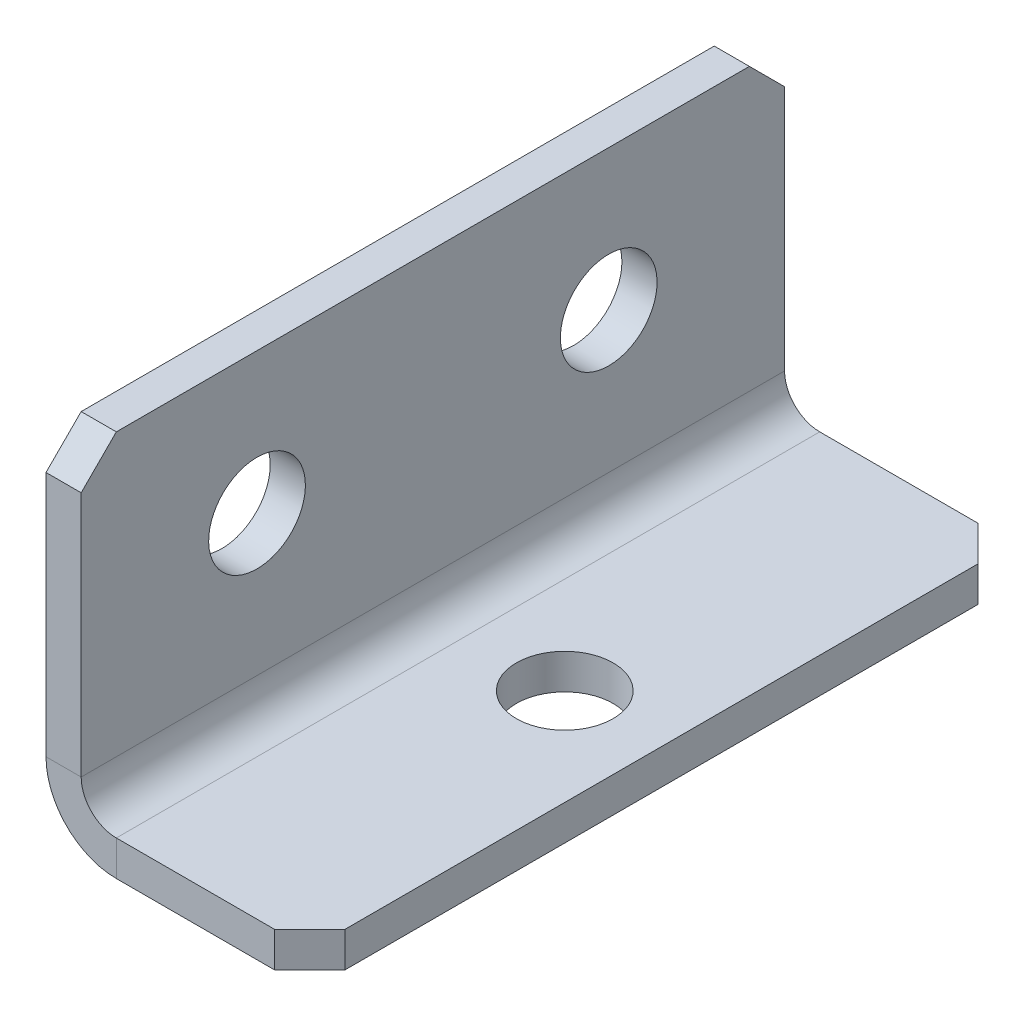
ISO-10303-21;
HEADER;
FILE_DESCRIPTION(('STEP AP214'),'2;1');
FILE_NAME('part.step','',(''),(''),'','','');
FILE_SCHEMA(('AUTOMOTIVE_DESIGN { 1 0 10303 214 1 1 1 1 }'));
ENDSEC;
DATA;
#1=APPLICATION_CONTEXT('core data for automotive mechanical design processes');
#2=APPLICATION_PROTOCOL_DEFINITION('international standard','automotive_design',2000,#1);
#3=PRODUCT_CONTEXT('',#1,'mechanical');
#4=PRODUCT('Part','Part','',(#3));
#5=PRODUCT_RELATED_PRODUCT_CATEGORY('part','',(#4));
#6=PRODUCT_DEFINITION_FORMATION('','',#4);
#7=PRODUCT_DEFINITION_CONTEXT('part definition',#1,'design');
#8=PRODUCT_DEFINITION('design','',#6,#7);
#9=PRODUCT_DEFINITION_SHAPE('','',#8);
#10=(LENGTH_UNIT() NAMED_UNIT(*) SI_UNIT(.MILLI.,.METRE.));
#11=(NAMED_UNIT(*) PLANE_ANGLE_UNIT() SI_UNIT($,.RADIAN.));
#12=(NAMED_UNIT(*) SI_UNIT($,.STERADIAN.) SOLID_ANGLE_UNIT());
#13=UNCERTAINTY_MEASURE_WITH_UNIT(LENGTH_MEASURE(1.E-05),#10,'distance_accuracy_value','');
#14=(GEOMETRIC_REPRESENTATION_CONTEXT(3) GLOBAL_UNCERTAINTY_ASSIGNED_CONTEXT((#13)) GLOBAL_UNIT_ASSIGNED_CONTEXT((#10,
#11,#12)) REPRESENTATION_CONTEXT('',''));
#15=CARTESIAN_POINT('',(0.,0.,0.));
#16=DIRECTION('',(0.,0.,1.));
#17=DIRECTION('',(1.,0.,0.));
#18=AXIS2_PLACEMENT_3D('',#15,#16,#17);
#19=CARTESIAN_POINT('',(2.,20.,-18.));
#20=DIRECTION('',(0.,0.707106781186548,-0.707106781186548));
#21=DIRECTION('',(0.,-0.707106781186548,-0.707106781186548));
#22=AXIS2_PLACEMENT_3D('',#19,#20,#21);
#23=PLANE('',#22);
#24=DIRECTION('',(1.,0.,0.));
#25=VECTOR('',#24,1.);
#26=CARTESIAN_POINT('',(2.,18.,-20.));
#27=LINE('',#26,#25);
#28=CARTESIAN_POINT('',(0.,18.,-20.));
#29=VERTEX_POINT('',#28);
#30=CARTESIAN_POINT('',(2.,18.,-20.));
#31=VERTEX_POINT('',#30);
#32=EDGE_CURVE('E11',#29,#31,#27,.T.);
#33=ORIENTED_EDGE('',*,*,#32,.F.);
#34=DIRECTION('',(0.,-0.707106781186548,-0.707106781186548));
#35=VECTOR('',#34,1.);
#36=CARTESIAN_POINT('',(0.,20.,-18.));
#37=LINE('',#36,#35);
#38=CARTESIAN_POINT('',(0.,20.,-18.));
#39=VERTEX_POINT('',#38);
#40=EDGE_CURVE('E111',#29,#39,#37,.F.);
#41=ORIENTED_EDGE('',*,*,#40,.T.);
#42=DIRECTION('',(1.,0.,0.));
#43=VECTOR('',#42,1.);
#44=CARTESIAN_POINT('',(2.,20.,-18.));
#45=LINE('',#44,#43);
#46=CARTESIAN_POINT('',(2.,20.,-18.));
#47=VERTEX_POINT('',#46);
#48=EDGE_CURVE('E60',#39,#47,#45,.T.);
#49=ORIENTED_EDGE('',*,*,#48,.T.);
#50=DIRECTION('',(0.,-0.707106781186548,-0.707106781186548));
#51=VECTOR('',#50,1.);
#52=CARTESIAN_POINT('',(2.,20.,-18.));
#53=LINE('',#52,#51);
#54=EDGE_CURVE('E113',#31,#47,#53,.F.);
#55=ORIENTED_EDGE('',*,*,#54,.F.);
#56=EDGE_LOOP('',(#33,#41,#49,#55));
#57=FACE_BOUND('',#56,.T.);
#58=ADVANCED_FACE('F49',(#57),#23,.T.);
#59=CARTESIAN_POINT('',(2.,20.,20.));
#60=DIRECTION('',(0.,1.,0.));
#61=DIRECTION('',(0.,0.,-1.));
#62=AXIS2_PLACEMENT_3D('',#59,#60,#61);
#63=PLANE('',#62);
#64=ORIENTED_EDGE('',*,*,#48,.F.);
#65=DIRECTION('',(0.,0.,1.));
#66=VECTOR('',#65,1.);
#67=CARTESIAN_POINT('',(0.,20.,20.));
#68=LINE('',#67,#66);
#69=CARTESIAN_POINT('',(0.,20.,18.));
#70=VERTEX_POINT('',#69);
#71=EDGE_CURVE('E127',#70,#39,#68,.F.);
#72=ORIENTED_EDGE('',*,*,#71,.F.);
#73=DIRECTION('',(1.,0.,0.));
#74=VECTOR('',#73,1.);
#75=CARTESIAN_POINT('',(2.,20.,18.));
#76=LINE('',#75,#74);
#77=CARTESIAN_POINT('',(2.,20.,18.));
#78=VERTEX_POINT('',#77);
#79=EDGE_CURVE('E183',#70,#78,#76,.T.);
#80=ORIENTED_EDGE('',*,*,#79,.T.);
#81=DIRECTION('',(0.,0.,-1.));
#82=VECTOR('',#81,1.);
#83=CARTESIAN_POINT('',(2.,20.,20.));
#84=LINE('',#83,#82);
#85=EDGE_CURVE('E199',#78,#47,#84,.T.);
#86=ORIENTED_EDGE('',*,*,#85,.T.);
#87=EDGE_LOOP('',(#64,#72,#80,#86));
#88=FACE_BOUND('',#87,.T.);
#89=ADVANCED_FACE('F205',(#88),#63,.T.);
#90=CARTESIAN_POINT('',(2.,18.,20.));
#91=DIRECTION('',(0.,-0.707106781186548,-0.707106781186548));
#92=DIRECTION('',(0.,-0.707106781186548,0.707106781186548));
#93=AXIS2_PLACEMENT_3D('',#90,#91,#92);
#94=PLANE('',#93);
#95=ORIENTED_EDGE('',*,*,#79,.F.);
#96=DIRECTION('',(0.,-0.707106781186548,0.707106781186548));
#97=VECTOR('',#96,1.);
#98=CARTESIAN_POINT('',(0.,18.,20.));
#99=LINE('',#98,#97);
#100=CARTESIAN_POINT('',(0.,18.,20.));
#101=VERTEX_POINT('',#100);
#102=EDGE_CURVE('E293',#70,#101,#99,.T.);
#103=ORIENTED_EDGE('',*,*,#102,.T.);
#104=DIRECTION('',(1.,0.,0.));
#105=VECTOR('',#104,1.);
#106=CARTESIAN_POINT('',(2.,18.,20.));
#107=LINE('',#106,#105);
#108=CARTESIAN_POINT('',(2.,18.,20.));
#109=VERTEX_POINT('',#108);
#110=EDGE_CURVE('E179',#101,#109,#107,.T.);
#111=ORIENTED_EDGE('',*,*,#110,.T.);
#112=DIRECTION('',(0.,-0.707106781186548,0.707106781186548));
#113=VECTOR('',#112,1.);
#114=CARTESIAN_POINT('',(2.,18.,20.));
#115=LINE('',#114,#113);
#116=EDGE_CURVE('E207',#78,#109,#115,.T.);
#117=ORIENTED_EDGE('',*,*,#116,.F.);
#118=EDGE_LOOP('',(#95,#103,#111,#117));
#119=FACE_BOUND('',#118,.T.);
#120=ADVANCED_FACE('F430',(#119),#94,.F.);
#121=CARTESIAN_POINT('',(2.,20.,20.));
#122=DIRECTION('',(0.,0.,1.));
#123=DIRECTION('',(0.,1.,0.));
#124=AXIS2_PLACEMENT_3D('',#121,#122,#123);
#125=PLANE('',#124);
#126=ORIENTED_EDGE('',*,*,#110,.F.);
#127=DIRECTION('',(0.,-1.,0.));
#128=VECTOR('',#127,1.);
#129=CARTESIAN_POINT('',(0.,20.,20.));
#130=LINE('',#129,#128);
#131=CARTESIAN_POINT('',(0.,4.,20.));
#132=VERTEX_POINT('',#131);
#133=EDGE_CURVE('E259',#132,#101,#130,.F.);
#134=ORIENTED_EDGE('',*,*,#133,.F.);
#135=DIRECTION('',(1.,0.,0.));
#136=VECTOR('',#135,1.);
#137=CARTESIAN_POINT('',(2.,4.,20.));
#138=LINE('',#137,#136);
#139=CARTESIAN_POINT('',(2.,4.,20.));
#140=VERTEX_POINT('',#139);
#141=EDGE_CURVE('E175',#132,#140,#138,.T.);
#142=ORIENTED_EDGE('',*,*,#141,.T.);
#143=DIRECTION('',(0.,1.,0.));
#144=VECTOR('',#143,1.);
#145=CARTESIAN_POINT('',(2.,20.,20.));
#146=LINE('',#145,#144);
#147=EDGE_CURVE('E212',#140,#109,#146,.T.);
#148=ORIENTED_EDGE('',*,*,#147,.T.);
#149=EDGE_LOOP('',(#126,#134,#142,#148));
#150=FACE_BOUND('',#149,.T.);
#151=ADVANCED_FACE('F432',(#150),#125,.T.);
#152=CARTESIAN_POINT('',(4.,4.,20.));
#153=DIRECTION('',(0.,0.,1.));
#154=DIRECTION('',(1.,0.,0.));
#155=AXIS2_PLACEMENT_3D('',#152,#153,#154);
#156=PLANE('',#155);
#157=ORIENTED_EDGE('',*,*,#141,.F.);
#158=CARTESIAN_POINT('',(4.,4.,20.));
#159=DIRECTION('',(0.,0.,-1.));
#160=DIRECTION('',(-1.,0.,0.));
#161=AXIS2_PLACEMENT_3D('',#158,#159,#160);
#162=CIRCLE('',#161,4.);
#163=CARTESIAN_POINT('',(4.,0.,20.));
#164=VERTEX_POINT('',#163);
#165=EDGE_CURVE('E269',#164,#132,#162,.T.);
#166=ORIENTED_EDGE('',*,*,#165,.F.);
#167=DIRECTION('',(0.,1.,0.));
#168=VECTOR('',#167,1.);
#169=CARTESIAN_POINT('',(4.,2.,20.));
#170=LINE('',#169,#168);
#171=CARTESIAN_POINT('',(4.,2.,20.));
#172=VERTEX_POINT('',#171);
#173=EDGE_CURVE('E171',#164,#172,#170,.T.);
#174=ORIENTED_EDGE('',*,*,#173,.T.);
#175=CARTESIAN_POINT('',(4.,4.,20.));
#176=DIRECTION('',(0.,0.,-1.));
#177=DIRECTION('',(1.,0.,0.));
#178=AXIS2_PLACEMENT_3D('',#175,#176,#177);
#179=CIRCLE('',#178,2.);
#180=EDGE_CURVE('E253',#172,#140,#179,.T.);
#181=ORIENTED_EDGE('',*,*,#180,.T.);
#182=EDGE_LOOP('',(#157,#166,#174,#181));
#183=FACE_BOUND('',#182,.T.);
#184=ADVANCED_FACE('F411',(#183),#156,.T.);
#185=CARTESIAN_POINT('',(4.,2.,20.));
#186=DIRECTION('',(0.,0.,1.));
#187=DIRECTION('',(-1.,0.,0.));
#188=AXIS2_PLACEMENT_3D('',#185,#186,#187);
#189=PLANE('',#188);
#190=ORIENTED_EDGE('',*,*,#173,.F.);
#191=DIRECTION('',(1.,0.,0.));
#192=VECTOR('',#191,1.);
#193=CARTESIAN_POINT('',(4.,0.,20.));
#194=LINE('',#193,#192);
#195=CARTESIAN_POINT('',(13.,0.,20.));
#196=VERTEX_POINT('',#195);
#197=EDGE_CURVE('E264',#196,#164,#194,.F.);
#198=ORIENTED_EDGE('',*,*,#197,.F.);
#199=DIRECTION('',(0.,1.,0.));
#200=VECTOR('',#199,1.);
#201=CARTESIAN_POINT('',(13.,2.,20.));
#202=LINE('',#201,#200);
#203=CARTESIAN_POINT('',(13.,2.,20.));
#204=VERTEX_POINT('',#203);
#205=EDGE_CURVE('E168',#196,#204,#202,.T.);
#206=ORIENTED_EDGE('',*,*,#205,.T.);
#207=DIRECTION('',(-1.,0.,0.));
#208=VECTOR('',#207,1.);
#209=CARTESIAN_POINT('',(4.,2.,20.));
#210=LINE('',#209,#208);
#211=EDGE_CURVE('E242',#204,#172,#210,.T.);
#212=ORIENTED_EDGE('',*,*,#211,.T.);
#213=EDGE_LOOP('',(#190,#198,#206,#212));
#214=FACE_BOUND('',#213,.T.);
#215=ADVANCED_FACE('F442',(#214),#189,.T.);
#216=CARTESIAN_POINT('',(13.,2.,20.));
#217=DIRECTION('',(-0.707106781186548,0.,-0.707106781186548));
#218=DIRECTION('',(0.707106781186548,0.,-0.707106781186548));
#219=AXIS2_PLACEMENT_3D('',#216,#217,#218);
#220=PLANE('',#219);
#221=ORIENTED_EDGE('',*,*,#205,.F.);
#222=DIRECTION('',(0.707106781186548,0.,-0.707106781186548));
#223=VECTOR('',#222,1.);
#224=CARTESIAN_POINT('',(13.,0.,20.));
#225=LINE('',#224,#223);
#226=CARTESIAN_POINT('',(15.,0.,18.));
#227=VERTEX_POINT('',#226);
#228=EDGE_CURVE('E270',#196,#227,#225,.T.);
#229=ORIENTED_EDGE('',*,*,#228,.T.);
#230=DIRECTION('',(0.,1.,0.));
#231=VECTOR('',#230,1.);
#232=CARTESIAN_POINT('',(15.,2.,18.));
#233=LINE('',#232,#231);
#234=CARTESIAN_POINT('',(15.,2.,18.));
#235=VERTEX_POINT('',#234);
#236=EDGE_CURVE('E68',#227,#235,#233,.T.);
#237=ORIENTED_EDGE('',*,*,#236,.T.);
#238=DIRECTION('',(0.707106781186548,0.,-0.707106781186548));
#239=VECTOR('',#238,1.);
#240=CARTESIAN_POINT('',(13.,2.,20.));
#241=LINE('',#240,#239);
#242=EDGE_CURVE('E246',#204,#235,#241,.T.);
#243=ORIENTED_EDGE('',*,*,#242,.F.);
#244=EDGE_LOOP('',(#221,#229,#237,#243));
#245=FACE_BOUND('',#244,.T.);
#246=ADVANCED_FACE('F443',(#245),#220,.F.);
#247=CARTESIAN_POINT('',(15.,2.,20.));
#248=DIRECTION('',(-1.,0.,0.));
#249=DIRECTION('',(0.,0.,-1.));
#250=AXIS2_PLACEMENT_3D('',#247,#248,#249);
#251=PLANE('',#250);
#252=ORIENTED_EDGE('',*,*,#236,.F.);
#253=DIRECTION('',(0.,0.,1.));
#254=VECTOR('',#253,1.);
#255=CARTESIAN_POINT('',(15.,0.,20.));
#256=LINE('',#255,#254);
#257=CARTESIAN_POINT('',(15.,0.,-18.));
#258=VERTEX_POINT('',#257);
#259=EDGE_CURVE('E149',#227,#258,#256,.F.);
#260=ORIENTED_EDGE('',*,*,#259,.T.);
#261=DIRECTION('',(0.,1.,0.));
#262=VECTOR('',#261,1.);
#263=CARTESIAN_POINT('',(15.,2.,-18.));
#264=LINE('',#263,#262);
#265=CARTESIAN_POINT('',(15.,2.,-18.));
#266=VERTEX_POINT('',#265);
#267=EDGE_CURVE('E162',#258,#266,#264,.T.);
#268=ORIENTED_EDGE('',*,*,#267,.T.);
#269=DIRECTION('',(0.,0.,-1.));
#270=VECTOR('',#269,1.);
#271=CARTESIAN_POINT('',(15.,2.,20.));
#272=LINE('',#271,#270);
#273=EDGE_CURVE('E226',#235,#266,#272,.T.);
#274=ORIENTED_EDGE('',*,*,#273,.F.);
#275=EDGE_LOOP('',(#252,#260,#268,#274));
#276=FACE_BOUND('',#275,.T.);
#277=ADVANCED_FACE('F446',(#276),#251,.F.);
#278=CARTESIAN_POINT('',(15.,2.,-18.));
#279=DIRECTION('',(0.707106781186548,0.,-0.707106781186548));
#280=DIRECTION('',(0.707106781186548,0.,0.707106781186548));
#281=AXIS2_PLACEMENT_3D('',#278,#279,#280);
#282=PLANE('',#281);
#283=ORIENTED_EDGE('',*,*,#267,.F.);
#284=DIRECTION('',(0.707106781186548,0.,0.707106781186548));
#285=VECTOR('',#284,1.);
#286=CARTESIAN_POINT('',(15.,0.,-18.));
#287=LINE('',#286,#285);
#288=CARTESIAN_POINT('',(13.,0.,-20.));
#289=VERTEX_POINT('',#288);
#290=EDGE_CURVE('E274',#258,#289,#287,.F.);
#291=ORIENTED_EDGE('',*,*,#290,.T.);
#292=DIRECTION('',(0.,1.,0.));
#293=VECTOR('',#292,1.);
#294=CARTESIAN_POINT('',(13.,2.,-20.));
#295=LINE('',#294,#293);
#296=CARTESIAN_POINT('',(13.,2.,-20.));
#297=VERTEX_POINT('',#296);
#298=EDGE_CURVE('E158',#289,#297,#295,.T.);
#299=ORIENTED_EDGE('',*,*,#298,.T.);
#300=DIRECTION('',(0.707106781186548,0.,0.707106781186548));
#301=VECTOR('',#300,1.);
#302=CARTESIAN_POINT('',(15.,2.,-18.));
#303=LINE('',#302,#301);
#304=EDGE_CURVE('E230',#266,#297,#303,.F.);
#305=ORIENTED_EDGE('',*,*,#304,.F.);
#306=EDGE_LOOP('',(#283,#291,#299,#305));
#307=FACE_BOUND('',#306,.T.);
#308=ADVANCED_FACE('F448',(#307),#282,.T.);
#309=CARTESIAN_POINT('',(4.,2.,-20.));
#310=DIRECTION('',(0.,0.,1.));
#311=DIRECTION('',(-1.,0.,0.));
#312=AXIS2_PLACEMENT_3D('',#309,#310,#311);
#313=PLANE('',#312);
#314=ORIENTED_EDGE('',*,*,#298,.F.);
#315=DIRECTION('',(1.,0.,0.));
#316=VECTOR('',#315,1.);
#317=CARTESIAN_POINT('',(4.,0.,-20.));
#318=LINE('',#317,#316);
#319=CARTESIAN_POINT('',(4.,0.,-20.));
#320=VERTEX_POINT('',#319);
#321=EDGE_CURVE('E265',#289,#320,#318,.F.);
#322=ORIENTED_EDGE('',*,*,#321,.T.);
#323=DIRECTION('',(0.,1.,0.));
#324=VECTOR('',#323,1.);
#325=CARTESIAN_POINT('',(4.,2.,-20.));
#326=LINE('',#325,#324);
#327=CARTESIAN_POINT('',(4.,2.,-20.));
#328=VERTEX_POINT('',#327);
#329=EDGE_CURVE('E154',#320,#328,#326,.T.);
#330=ORIENTED_EDGE('',*,*,#329,.T.);
#331=DIRECTION('',(-1.,0.,0.));
#332=VECTOR('',#331,1.);
#333=CARTESIAN_POINT('',(4.,2.,-20.));
#334=LINE('',#333,#332);
#335=EDGE_CURVE('E234',#297,#328,#334,.T.);
#336=ORIENTED_EDGE('',*,*,#335,.F.);
#337=EDGE_LOOP('',(#314,#322,#330,#336));
#338=FACE_BOUND('',#337,.T.);
#339=ADVANCED_FACE('F421',(#338),#313,.F.);
#340=CARTESIAN_POINT('',(4.,4.,-20.));
#341=DIRECTION('',(0.,0.,1.));
#342=DIRECTION('',(1.,0.,0.));
#343=AXIS2_PLACEMENT_3D('',#340,#341,#342);
#344=PLANE('',#343);
#345=ORIENTED_EDGE('',*,*,#329,.F.);
#346=CARTESIAN_POINT('',(4.,4.,-20.));
#347=DIRECTION('',(0.,0.,-1.));
#348=DIRECTION('',(-1.,0.,0.));
#349=AXIS2_PLACEMENT_3D('',#346,#347,#348);
#350=CIRCLE('',#349,4.);
#351=CARTESIAN_POINT('',(0.,4.,-20.));
#352=VERTEX_POINT('',#351);
#353=EDGE_CURVE('E266',#320,#352,#350,.T.);
#354=ORIENTED_EDGE('',*,*,#353,.T.);
#355=DIRECTION('',(1.,0.,0.));
#356=VECTOR('',#355,1.);
#357=CARTESIAN_POINT('',(2.,4.,-20.));
#358=LINE('',#357,#356);
#359=CARTESIAN_POINT('',(2.,4.,-20.));
#360=VERTEX_POINT('',#359);
#361=EDGE_CURVE('E53',#352,#360,#358,.T.);
#362=ORIENTED_EDGE('',*,*,#361,.T.);
#363=CARTESIAN_POINT('',(4.,4.,-20.));
#364=DIRECTION('',(0.,0.,-1.));
#365=DIRECTION('',(1.,0.,0.));
#366=AXIS2_PLACEMENT_3D('',#363,#364,#365);
#367=CIRCLE('',#366,2.);
#368=EDGE_CURVE('E249',#328,#360,#367,.T.);
#369=ORIENTED_EDGE('',*,*,#368,.F.);
#370=EDGE_LOOP('',(#345,#354,#362,#369));
#371=FACE_BOUND('',#370,.T.);
#372=ADVANCED_FACE('F395',(#371),#344,.F.);
#373=CARTESIAN_POINT('',(2.,12.,10.));
#374=DIRECTION('',(-1.,0.,0.));
#375=DIRECTION('',(0.,-1.,0.));
#376=AXIS2_PLACEMENT_3D('',#373,#374,#375);
#377=CYLINDRICAL_SURFACE('',#376,2.75);
#378=CARTESIAN_POINT('',(2.,12.,10.));
#379=DIRECTION('',(1.,0.,0.));
#380=DIRECTION('',(0.,1.,0.));
#381=AXIS2_PLACEMENT_3D('',#378,#379,#380);
#382=CIRCLE('',#381,2.75);
#383=CARTESIAN_POINT('',(2.,14.75,10.));
#384=VERTEX_POINT('',#383);
#385=EDGE_CURVE('E289',#384,#384,#382,.T.);
#386=ORIENTED_EDGE('',*,*,#385,.T.);
#387=EDGE_LOOP('',(#386));
#388=FACE_BOUND('',#387,.T.);
#389=CARTESIAN_POINT('',(0.,12.,10.));
#390=DIRECTION('',(1.,0.,0.));
#391=DIRECTION('',(0.,1.,0.));
#392=AXIS2_PLACEMENT_3D('',#389,#390,#391);
#393=CIRCLE('',#392,2.75);
#394=CARTESIAN_POINT('',(0.,14.75,10.));
#395=VERTEX_POINT('',#394);
#396=EDGE_CURVE('E141',#395,#395,#393,.T.);
#397=ORIENTED_EDGE('',*,*,#396,.F.);
#398=EDGE_LOOP('',(#397));
#399=FACE_BOUND('',#398,.T.);
#400=ADVANCED_FACE('F470',(#388,#399),#377,.F.);
#401=CARTESIAN_POINT('',(2.,12.,-10.));
#402=DIRECTION('',(-1.,0.,0.));
#403=DIRECTION('',(0.,-1.,0.));
#404=AXIS2_PLACEMENT_3D('',#401,#402,#403);
#405=CYLINDRICAL_SURFACE('',#404,2.75);
#406=CARTESIAN_POINT('',(2.,12.,-10.));
#407=DIRECTION('',(1.,0.,0.));
#408=DIRECTION('',(0.,-1.,0.));
#409=AXIS2_PLACEMENT_3D('',#406,#407,#408);
#410=CIRCLE('',#409,2.75);
#411=CARTESIAN_POINT('',(2.,9.25,-10.));
#412=VERTEX_POINT('',#411);
#413=EDGE_CURVE('E334',#412,#412,#410,.T.);
#414=ORIENTED_EDGE('',*,*,#413,.T.);
#415=EDGE_LOOP('',(#414));
#416=FACE_BOUND('',#415,.T.);
#417=CARTESIAN_POINT('',(0.,12.,-10.));
#418=DIRECTION('',(1.,0.,0.));
#419=DIRECTION('',(0.,1.,0.));
#420=AXIS2_PLACEMENT_3D('',#417,#418,#419);
#421=CIRCLE('',#420,2.75);
#422=CARTESIAN_POINT('',(0.,14.75,-10.));
#423=VERTEX_POINT('',#422);
#424=EDGE_CURVE('E135',#423,#423,#421,.T.);
#425=ORIENTED_EDGE('',*,*,#424,.F.);
#426=EDGE_LOOP('',(#425));
#427=FACE_BOUND('',#426,.T.);
#428=ADVANCED_FACE('F51',(#416,#427),#405,.F.);
#429=CARTESIAN_POINT('',(9.5,2.,0.));
#430=DIRECTION('',(0.,-1.,0.));
#431=DIRECTION('',(1.,0.,0.));
#432=AXIS2_PLACEMENT_3D('',#429,#430,#431);
#433=CYLINDRICAL_SURFACE('',#432,2.75);
#434=CARTESIAN_POINT('',(9.5,2.,0.));
#435=DIRECTION('',(0.,1.,0.));
#436=DIRECTION('',(-1.,0.,0.));
#437=AXIS2_PLACEMENT_3D('',#434,#435,#436);
#438=CIRCLE('',#437,2.75);
#439=CARTESIAN_POINT('',(6.75,2.,0.));
#440=VERTEX_POINT('',#439);
#441=EDGE_CURVE('E222',#440,#440,#438,.T.);
#442=ORIENTED_EDGE('',*,*,#441,.T.);
#443=EDGE_LOOP('',(#442));
#444=FACE_BOUND('',#443,.T.);
#445=CARTESIAN_POINT('',(9.5,0.,0.));
#446=DIRECTION('',(0.,1.,0.));
#447=DIRECTION('',(-1.,0.,0.));
#448=AXIS2_PLACEMENT_3D('',#445,#446,#447);
#449=CIRCLE('',#448,2.75);
#450=CARTESIAN_POINT('',(6.75,0.,0.));
#451=VERTEX_POINT('',#450);
#452=EDGE_CURVE('E145',#451,#451,#449,.T.);
#453=ORIENTED_EDGE('',*,*,#452,.F.);
#454=EDGE_LOOP('',(#453));
#455=FACE_BOUND('',#454,.T.);
#456=ADVANCED_FACE('F467',(#444,#455),#433,.F.);
#457=CARTESIAN_POINT('',(2.,20.,-20.));
#458=DIRECTION('',(0.,0.,1.));
#459=DIRECTION('',(0.,1.,0.));
#460=AXIS2_PLACEMENT_3D('',#457,#458,#459);
#461=PLANE('',#460);
#462=DIRECTION('',(0.,-1.,0.));
#463=VECTOR('',#462,1.);
#464=CARTESIAN_POINT('',(0.,20.,-20.));
#465=LINE('',#464,#463);
#466=EDGE_CURVE('E123',#352,#29,#465,.F.);
#467=ORIENTED_EDGE('',*,*,#466,.T.);
#468=ORIENTED_EDGE('',*,*,#32,.T.);
#469=DIRECTION('',(0.,1.,0.));
#470=VECTOR('',#469,1.);
#471=CARTESIAN_POINT('',(2.,20.,-20.));
#472=LINE('',#471,#470);
#473=EDGE_CURVE('E202',#360,#31,#472,.T.);
#474=ORIENTED_EDGE('',*,*,#473,.F.);
#475=ORIENTED_EDGE('',*,*,#361,.F.);
#476=EDGE_LOOP('',(#467,#468,#474,#475));
#477=FACE_BOUND('',#476,.T.);
#478=ADVANCED_FACE('F131',(#477),#461,.F.);
#479=CARTESIAN_POINT('',(4.,4.,20.));
#480=DIRECTION('',(0.,0.,-1.));
#481=DIRECTION('',(-1.,0.,0.));
#482=AXIS2_PLACEMENT_3D('',#479,#480,#481);
#483=CYLINDRICAL_SURFACE('',#482,2.);
#484=ORIENTED_EDGE('',*,*,#368,.T.);
#485=DIRECTION('',(0.,0.,-1.));
#486=VECTOR('',#485,1.);
#487=CARTESIAN_POINT('',(2.,4.,20.));
#488=LINE('',#487,#486);
#489=EDGE_CURVE('E219',#140,#360,#488,.T.);
#490=ORIENTED_EDGE('',*,*,#489,.F.);
#491=ORIENTED_EDGE('',*,*,#180,.F.);
#492=DIRECTION('',(0.,0.,-1.));
#493=VECTOR('',#492,1.);
#494=CARTESIAN_POINT('',(4.,2.,20.));
#495=LINE('',#494,#493);
#496=EDGE_CURVE('E238',#172,#328,#495,.T.);
#497=ORIENTED_EDGE('',*,*,#496,.T.);
#498=EDGE_LOOP('',(#484,#490,#491,#497));
#499=FACE_BOUND('',#498,.T.);
#500=ADVANCED_FACE('F403',(#499),#483,.F.);
#501=CARTESIAN_POINT('',(4.,2.,20.));
#502=DIRECTION('',(0.,-1.,0.));
#503=DIRECTION('',(1.,0.,0.));
#504=AXIS2_PLACEMENT_3D('',#501,#502,#503);
#505=PLANE('',#504);
#506=ORIENTED_EDGE('',*,*,#441,.F.);
#507=EDGE_LOOP('',(#506));
#508=FACE_BOUND('',#507,.T.);
#509=ORIENTED_EDGE('',*,*,#273,.T.);
#510=ORIENTED_EDGE('',*,*,#304,.T.);
#511=ORIENTED_EDGE('',*,*,#335,.T.);
#512=ORIENTED_EDGE('',*,*,#496,.F.);
#513=ORIENTED_EDGE('',*,*,#211,.F.);
#514=ORIENTED_EDGE('',*,*,#242,.T.);
#515=EDGE_LOOP('',(#509,#510,#511,#512,#513,#514));
#516=FACE_BOUND('',#515,.T.);
#517=ADVANCED_FACE('F415',(#508,#516),#505,.F.);
#518=CARTESIAN_POINT('',(2.,20.,20.));
#519=DIRECTION('',(-1.,0.,0.));
#520=DIRECTION('',(0.,-1.,0.));
#521=AXIS2_PLACEMENT_3D('',#518,#519,#520);
#522=PLANE('',#521);
#523=ORIENTED_EDGE('',*,*,#385,.F.);
#524=EDGE_LOOP('',(#523));
#525=FACE_BOUND('',#524,.T.);
#526=ORIENTED_EDGE('',*,*,#413,.F.);
#527=EDGE_LOOP('',(#526));
#528=FACE_BOUND('',#527,.T.);
#529=ORIENTED_EDGE('',*,*,#473,.T.);
#530=ORIENTED_EDGE('',*,*,#54,.T.);
#531=ORIENTED_EDGE('',*,*,#85,.F.);
#532=ORIENTED_EDGE('',*,*,#116,.T.);
#533=ORIENTED_EDGE('',*,*,#147,.F.);
#534=ORIENTED_EDGE('',*,*,#489,.T.);
#535=EDGE_LOOP('',(#529,#530,#531,#532,#533,#534));
#536=FACE_BOUND('',#535,.T.);
#537=ADVANCED_FACE('F197',(#525,#528,#536),#522,.F.);
#538=CARTESIAN_POINT('',(4.,4.,20.));
#539=DIRECTION('',(0.,0.,-1.));
#540=DIRECTION('',(-1.,0.,0.));
#541=AXIS2_PLACEMENT_3D('',#538,#539,#540);
#542=CYLINDRICAL_SURFACE('',#541,4.);
#543=ORIENTED_EDGE('',*,*,#353,.F.);
#544=DIRECTION('',(0.,0.,-1.));
#545=VECTOR('',#544,1.);
#546=CARTESIAN_POINT('',(4.,0.,20.));
#547=LINE('',#546,#545);
#548=EDGE_CURVE('E260',#164,#320,#547,.T.);
#549=ORIENTED_EDGE('',*,*,#548,.F.);
#550=ORIENTED_EDGE('',*,*,#165,.T.);
#551=DIRECTION('',(0.,0.,1.));
#552=VECTOR('',#551,1.);
#553=CARTESIAN_POINT('',(0.,4.,20.));
#554=LINE('',#553,#552);
#555=EDGE_CURVE('E150',#132,#352,#554,.F.);
#556=ORIENTED_EDGE('',*,*,#555,.T.);
#557=EDGE_LOOP('',(#543,#549,#550,#556));
#558=FACE_BOUND('',#557,.T.);
#559=ADVANCED_FACE('F434',(#558),#542,.T.);
#560=CARTESIAN_POINT('',(4.,0.,20.));
#561=DIRECTION('',(0.,-1.,0.));
#562=DIRECTION('',(1.,0.,0.));
#563=AXIS2_PLACEMENT_3D('',#560,#561,#562);
#564=PLANE('',#563);
#565=ORIENTED_EDGE('',*,*,#452,.T.);
#566=EDGE_LOOP('',(#565));
#567=FACE_BOUND('',#566,.T.);
#568=ORIENTED_EDGE('',*,*,#259,.F.);
#569=ORIENTED_EDGE('',*,*,#228,.F.);
#570=ORIENTED_EDGE('',*,*,#197,.T.);
#571=ORIENTED_EDGE('',*,*,#548,.T.);
#572=ORIENTED_EDGE('',*,*,#321,.F.);
#573=ORIENTED_EDGE('',*,*,#290,.F.);
#574=EDGE_LOOP('',(#568,#569,#570,#571,#572,#573));
#575=FACE_BOUND('',#574,.T.);
#576=ADVANCED_FACE('F440',(#567,#575),#564,.T.);
#577=CARTESIAN_POINT('',(0.,20.,20.));
#578=DIRECTION('',(-1.,0.,0.));
#579=DIRECTION('',(0.,-1.,0.));
#580=AXIS2_PLACEMENT_3D('',#577,#578,#579);
#581=PLANE('',#580);
#582=ORIENTED_EDGE('',*,*,#396,.T.);
#583=EDGE_LOOP('',(#582));
#584=FACE_BOUND('',#583,.T.);
#585=ORIENTED_EDGE('',*,*,#424,.T.);
#586=EDGE_LOOP('',(#585));
#587=FACE_BOUND('',#586,.T.);
#588=ORIENTED_EDGE('',*,*,#466,.F.);
#589=ORIENTED_EDGE('',*,*,#555,.F.);
#590=ORIENTED_EDGE('',*,*,#133,.T.);
#591=ORIENTED_EDGE('',*,*,#102,.F.);
#592=ORIENTED_EDGE('',*,*,#71,.T.);
#593=ORIENTED_EDGE('',*,*,#40,.F.);
#594=EDGE_LOOP('',(#588,#589,#590,#591,#592,#593));
#595=FACE_BOUND('',#594,.T.);
#596=ADVANCED_FACE('F121',(#584,#587,#595),#581,.T.);
#597=CLOSED_SHELL('',(#58,#89,#120,#151,#184,#215,#246,#277,#308,#339,#372,#400,#428,#456,#478,
#500,#517,#537,#559,#576,#596));
#598=MANIFOLD_SOLID_BREP('B2',#597);
#599=ADVANCED_BREP_SHAPE_REPRESENTATION('',(#18,#598),#14);
#600=SHAPE_DEFINITION_REPRESENTATION(#9,#599);
ENDSEC;
END-ISO-10303-21;
